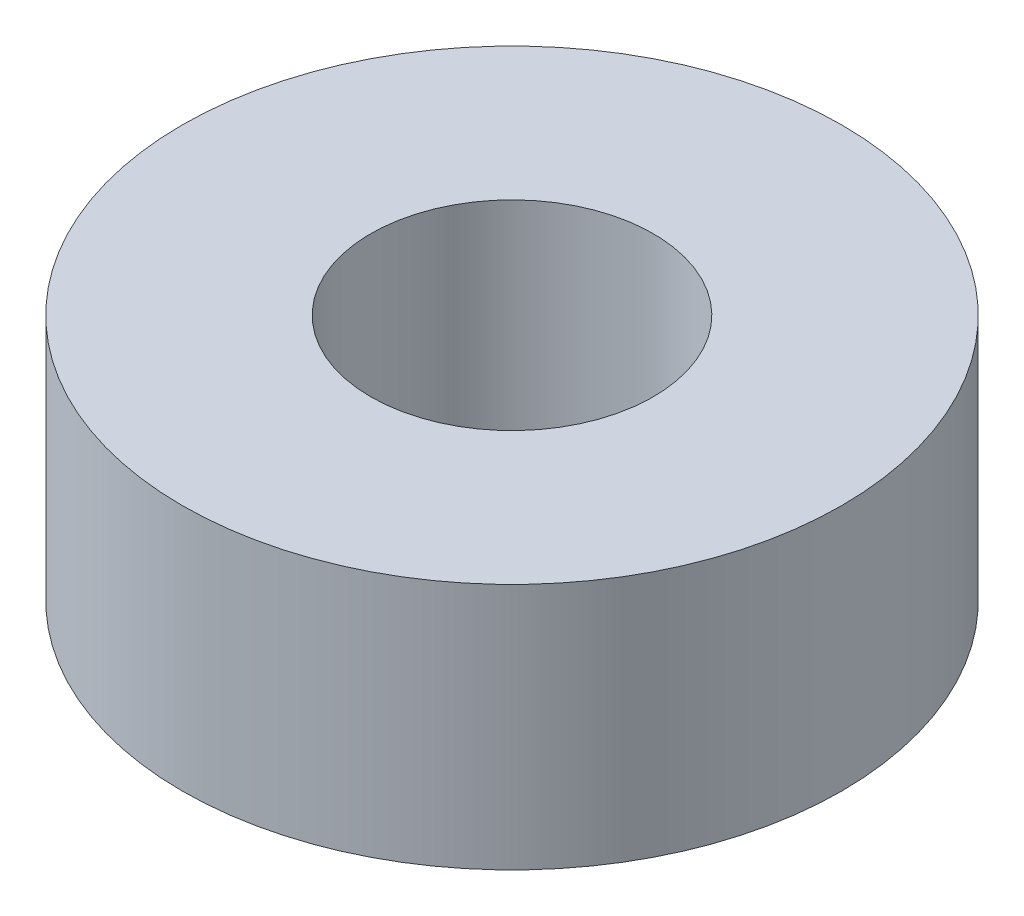
ISO-10303-21;
HEADER;
FILE_DESCRIPTION(('STEP AP214'),'2;1');
FILE_NAME('part.step','',(''),(''),'','','');
FILE_SCHEMA(('AUTOMOTIVE_DESIGN { 1 0 10303 214 1 1 1 1 }'));
ENDSEC;
DATA;
#1=APPLICATION_CONTEXT('core data for automotive mechanical design processes');
#2=APPLICATION_PROTOCOL_DEFINITION('international standard','automotive_design',2000,#1);
#3=PRODUCT_CONTEXT('',#1,'mechanical');
#4=PRODUCT('Part','Part','',(#3));
#5=PRODUCT_RELATED_PRODUCT_CATEGORY('part','',(#4));
#6=PRODUCT_DEFINITION_FORMATION('','',#4);
#7=PRODUCT_DEFINITION_CONTEXT('part definition',#1,'design');
#8=PRODUCT_DEFINITION('design','',#6,#7);
#9=PRODUCT_DEFINITION_SHAPE('','',#8);
#10=(LENGTH_UNIT() NAMED_UNIT(*) SI_UNIT(.MILLI.,.METRE.));
#11=(NAMED_UNIT(*) PLANE_ANGLE_UNIT() SI_UNIT($,.RADIAN.));
#12=(NAMED_UNIT(*) SI_UNIT($,.STERADIAN.) SOLID_ANGLE_UNIT());
#13=UNCERTAINTY_MEASURE_WITH_UNIT(LENGTH_MEASURE(1.E-05),#10,'distance_accuracy_value','');
#14=(GEOMETRIC_REPRESENTATION_CONTEXT(3) GLOBAL_UNCERTAINTY_ASSIGNED_CONTEXT((#13)) GLOBAL_UNIT_ASSIGNED_CONTEXT((#10,
#11,#12)) REPRESENTATION_CONTEXT('',''));
#15=CARTESIAN_POINT('',(0.,0.,0.));
#16=DIRECTION('',(0.,0.,1.));
#17=DIRECTION('',(1.,0.,0.));
#18=AXIS2_PLACEMENT_3D('',#15,#16,#17);
#19=CARTESIAN_POINT('',(0.,3.,0.));
#20=DIRECTION('',(0.,1.,0.));
#21=DIRECTION('',(0.,0.,1.));
#22=AXIS2_PLACEMENT_3D('',#19,#20,#21);
#23=PLANE('',#22);
#24=CARTESIAN_POINT('',(0.,3.,0.));
#25=DIRECTION('',(0.,1.,0.));
#26=DIRECTION('',(0.,0.,1.));
#27=AXIS2_PLACEMENT_3D('',#24,#25,#26);
#28=CIRCLE('',#27,4.);
#29=CARTESIAN_POINT('',(0.,3.,4.));
#30=VERTEX_POINT('',#29);
#31=EDGE_CURVE('E10',#30,#30,#28,.T.);
#32=ORIENTED_EDGE('',*,*,#31,.T.);
#33=EDGE_LOOP('',(#32));
#34=FACE_BOUND('',#33,.T.);
#35=CARTESIAN_POINT('',(0.,3.,0.));
#36=DIRECTION('',(0.,1.,0.));
#37=DIRECTION('',(0.,0.,1.));
#38=AXIS2_PLACEMENT_3D('',#35,#36,#37);
#39=CIRCLE('',#38,1.7145);
#40=CARTESIAN_POINT('',(0.,3.,1.7145));
#41=VERTEX_POINT('',#40);
#42=EDGE_CURVE('E42',#41,#41,#39,.T.);
#43=ORIENTED_EDGE('',*,*,#42,.F.);
#44=EDGE_LOOP('',(#43));
#45=FACE_BOUND('',#44,.T.);
#46=ADVANCED_FACE('F31',(#34,#45),#23,.T.);
#47=CARTESIAN_POINT('',(0.,0.,0.));
#48=DIRECTION('',(0.,1.,0.));
#49=DIRECTION('',(0.,0.,1.));
#50=AXIS2_PLACEMENT_3D('',#47,#48,#49);
#51=PLANE('',#50);
#52=CARTESIAN_POINT('',(0.,0.,0.));
#53=DIRECTION('',(0.,1.,0.));
#54=DIRECTION('',(0.,0.,1.));
#55=AXIS2_PLACEMENT_3D('',#52,#53,#54);
#56=CIRCLE('',#55,4.);
#57=CARTESIAN_POINT('',(0.,0.,4.));
#58=VERTEX_POINT('',#57);
#59=EDGE_CURVE('E35',#58,#58,#56,.T.);
#60=ORIENTED_EDGE('',*,*,#59,.F.);
#61=EDGE_LOOP('',(#60));
#62=FACE_BOUND('',#61,.T.);
#63=CARTESIAN_POINT('',(0.,0.,0.));
#64=DIRECTION('',(0.,1.,0.));
#65=DIRECTION('',(0.,0.,1.));
#66=AXIS2_PLACEMENT_3D('',#63,#64,#65);
#67=CIRCLE('',#66,1.7145);
#68=CARTESIAN_POINT('',(0.,0.,1.7145));
#69=VERTEX_POINT('',#68);
#70=EDGE_CURVE('E44',#69,#69,#67,.T.);
#71=ORIENTED_EDGE('',*,*,#70,.T.);
#72=EDGE_LOOP('',(#71));
#73=FACE_BOUND('',#72,.T.);
#74=ADVANCED_FACE('F54',(#62,#73),#51,.F.);
#75=CARTESIAN_POINT('',(0.,3.,0.));
#76=DIRECTION('',(0.,-1.,0.));
#77=DIRECTION('',(0.,0.,-1.));
#78=AXIS2_PLACEMENT_3D('',#75,#76,#77);
#79=CYLINDRICAL_SURFACE('',#78,4.);
#80=ORIENTED_EDGE('',*,*,#31,.F.);
#81=EDGE_LOOP('',(#80));
#82=FACE_BOUND('',#81,.T.);
#83=ORIENTED_EDGE('',*,*,#59,.T.);
#84=EDGE_LOOP('',(#83));
#85=FACE_BOUND('',#84,.T.);
#86=ADVANCED_FACE('F33',(#82,#85),#79,.T.);
#87=CARTESIAN_POINT('',(0.,3.,0.));
#88=DIRECTION('',(0.,-1.,0.));
#89=DIRECTION('',(0.,0.,-1.));
#90=AXIS2_PLACEMENT_3D('',#87,#88,#89);
#91=CYLINDRICAL_SURFACE('',#90,1.7145);
#92=ORIENTED_EDGE('',*,*,#42,.T.);
#93=EDGE_LOOP('',(#92));
#94=FACE_BOUND('',#93,.T.);
#95=ORIENTED_EDGE('',*,*,#70,.F.);
#96=EDGE_LOOP('',(#95));
#97=FACE_BOUND('',#96,.T.);
#98=ADVANCED_FACE('F50',(#94,#97),#91,.F.);
#99=CLOSED_SHELL('',(#46,#74,#86,#98));
#100=MANIFOLD_SOLID_BREP('B2',#99);
#101=ADVANCED_BREP_SHAPE_REPRESENTATION('',(#18,#100),#14);
#102=SHAPE_DEFINITION_REPRESENTATION(#9,#101);
ENDSEC;
END-ISO-10303-21;
